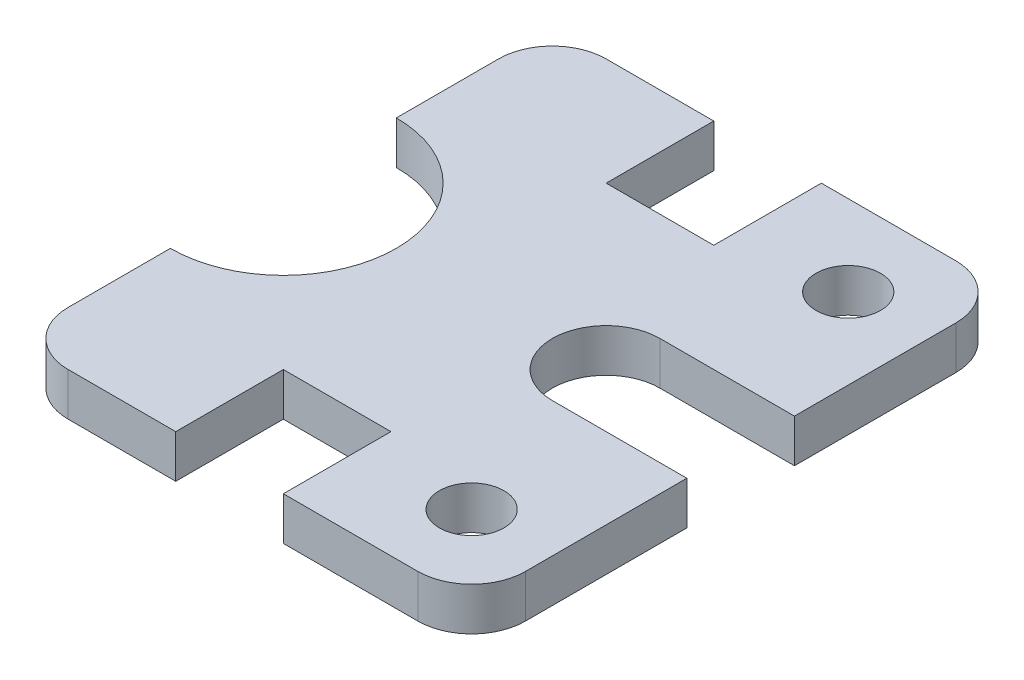
ISO-10303-21;
HEADER;
FILE_DESCRIPTION(('STEP AP214'),'2;1');
FILE_NAME('part.step','',(''),(''),'','','');
FILE_SCHEMA(('AUTOMOTIVE_DESIGN { 1 0 10303 214 1 1 1 1 }'));
ENDSEC;
DATA;
#1=APPLICATION_CONTEXT('core data for automotive mechanical design processes');
#2=APPLICATION_PROTOCOL_DEFINITION('international standard','automotive_design',2000,#1);
#3=PRODUCT_CONTEXT('',#1,'mechanical');
#4=PRODUCT('Part','Part','',(#3));
#5=PRODUCT_RELATED_PRODUCT_CATEGORY('part','',(#4));
#6=PRODUCT_DEFINITION_FORMATION('','',#4);
#7=PRODUCT_DEFINITION_CONTEXT('part definition',#1,'design');
#8=PRODUCT_DEFINITION('design','',#6,#7);
#9=PRODUCT_DEFINITION_SHAPE('','',#8);
#10=(LENGTH_UNIT() NAMED_UNIT(*) SI_UNIT(.MILLI.,.METRE.));
#11=(NAMED_UNIT(*) PLANE_ANGLE_UNIT() SI_UNIT($,.RADIAN.));
#12=(NAMED_UNIT(*) SI_UNIT($,.STERADIAN.) SOLID_ANGLE_UNIT());
#13=UNCERTAINTY_MEASURE_WITH_UNIT(LENGTH_MEASURE(1.E-05),#10,'distance_accuracy_value','');
#14=(GEOMETRIC_REPRESENTATION_CONTEXT(3) GLOBAL_UNCERTAINTY_ASSIGNED_CONTEXT((#13)) GLOBAL_UNIT_ASSIGNED_CONTEXT((#10,
#11,#12)) REPRESENTATION_CONTEXT('',''));
#15=CARTESIAN_POINT('',(0.,0.,0.));
#16=DIRECTION('',(0.,0.,1.));
#17=DIRECTION('',(1.,0.,0.));
#18=AXIS2_PLACEMENT_3D('',#15,#16,#17);
#19=CARTESIAN_POINT('',(-85.1016905402281,8.,10.1156747647356));
#20=DIRECTION('',(0.,1.,0.));
#21=DIRECTION('',(0.,0.,1.));
#22=AXIS2_PLACEMENT_3D('',#19,#20,#21);
#23=PLANE('',#22);
#24=CARTESIAN_POINT('',(-15.1016905402279,8.,-24.8843252352656));
#25=DIRECTION('',(0.,1.,0.));
#26=DIRECTION('',(0.,0.,1.));
#27=AXIS2_PLACEMENT_3D('',#24,#25,#26);
#28=CIRCLE('',#27,6.);
#29=CARTESIAN_POINT('',(-15.1016905402279,8.,-18.8843252352656));
#30=VERTEX_POINT('',#29);
#31=EDGE_CURVE('E222',#30,#30,#28,.T.);
#32=ORIENTED_EDGE('',*,*,#31,.F.);
#33=EDGE_LOOP('',(#32));
#34=FACE_BOUND('',#33,.T.);
#35=CARTESIAN_POINT('',(-85.1016905402281,8.,10.1156747647356));
#36=DIRECTION('',(0.,-1.,0.));
#37=DIRECTION('',(0.,0.,1.));
#38=AXIS2_PLACEMENT_3D('',#35,#36,#37);
#39=CIRCLE('',#38,21.);
#40=CARTESIAN_POINT('',(-85.1016905402281,8.,-10.8843252352644));
#41=VERTEX_POINT('',#40);
#42=CARTESIAN_POINT('',(-85.1016905402281,8.,31.1156747647356));
#43=VERTEX_POINT('',#42);
#44=EDGE_CURVE('E261',#41,#43,#39,.T.);
#45=ORIENTED_EDGE('',*,*,#44,.T.);
#46=DIRECTION('',(0.,0.,1.));
#47=VECTOR('',#46,1.);
#48=CARTESIAN_POINT('',(-85.1016905402281,8.,31.1156747647356));
#49=LINE('',#48,#47);
#50=CARTESIAN_POINT('',(-85.1016905402281,8.,50.1156747647355));
#51=VERTEX_POINT('',#50);
#52=EDGE_CURVE('E139',#43,#51,#49,.T.);
#53=ORIENTED_EDGE('',*,*,#52,.T.);
#54=CARTESIAN_POINT('',(-75.1016905402281,8.,50.1156747647356));
#55=DIRECTION('',(0.,1.,0.));
#56=DIRECTION('',(0.,0.,1.));
#57=AXIS2_PLACEMENT_3D('',#54,#55,#56);
#58=CIRCLE('',#57,10.);
#59=CARTESIAN_POINT('',(-75.101690540228,8.,60.1156747647356));
#60=VERTEX_POINT('',#59);
#61=EDGE_CURVE('E318',#51,#60,#58,.T.);
#62=ORIENTED_EDGE('',*,*,#61,.T.);
#63=DIRECTION('',(1.,0.,0.));
#64=VECTOR('',#63,1.);
#65=CARTESIAN_POINT('',(-75.101690540228,8.,60.1156747647356));
#66=LINE('',#65,#64);
#67=CARTESIAN_POINT('',(-55.1016905402281,8.,60.1156747647356));
#68=VERTEX_POINT('',#67);
#69=EDGE_CURVE('E337',#60,#68,#66,.T.);
#70=ORIENTED_EDGE('',*,*,#69,.T.);
#71=DIRECTION('',(0.,0.,-1.));
#72=VECTOR('',#71,1.);
#73=CARTESIAN_POINT('',(-55.1016905402281,8.,60.1156747647356));
#74=LINE('',#73,#72);
#75=CARTESIAN_POINT('',(-55.1016905402281,8.,40.1156747647356));
#76=VERTEX_POINT('',#75);
#77=EDGE_CURVE('E334',#68,#76,#74,.T.);
#78=ORIENTED_EDGE('',*,*,#77,.T.);
#79=DIRECTION('',(1.,0.,0.));
#80=VECTOR('',#79,1.);
#81=CARTESIAN_POINT('',(-55.1016905402281,8.,40.1156747647356));
#82=LINE('',#81,#80);
#83=CARTESIAN_POINT('',(-35.1016905402281,8.,40.1156747647356));
#84=VERTEX_POINT('',#83);
#85=EDGE_CURVE('E336',#76,#84,#82,.T.);
#86=ORIENTED_EDGE('',*,*,#85,.T.);
#87=DIRECTION('',(0.,0.,1.));
#88=VECTOR('',#87,1.);
#89=CARTESIAN_POINT('',(-35.1016905402279,8.,60.1156747647344));
#90=LINE('',#89,#88);
#91=CARTESIAN_POINT('',(-35.1016905402279,8.,60.1156747647344));
#92=VERTEX_POINT('',#91);
#93=EDGE_CURVE('E339',#84,#92,#90,.T.);
#94=ORIENTED_EDGE('',*,*,#93,.T.);
#95=DIRECTION('',(1.,0.,0.));
#96=VECTOR('',#95,1.);
#97=CARTESIAN_POINT('',(-35.1016905402279,8.,60.1156747647344));
#98=LINE('',#97,#96);
#99=CARTESIAN_POINT('',(-10.1016905402285,8.,60.1156747647344));
#100=VERTEX_POINT('',#99);
#101=EDGE_CURVE('E345',#92,#100,#98,.T.);
#102=ORIENTED_EDGE('',*,*,#101,.T.);
#103=CARTESIAN_POINT('',(-10.1016905402279,8.,50.1156747647344));
#104=DIRECTION('',(0.,1.,0.));
#105=DIRECTION('',(0.,0.,-1.));
#106=AXIS2_PLACEMENT_3D('',#103,#104,#105);
#107=CIRCLE('',#106,10.);
#108=CARTESIAN_POINT('',(-0.101690540227909,8.,50.1156747647344));
#109=VERTEX_POINT('',#108);
#110=EDGE_CURVE('E347',#100,#109,#107,.T.);
#111=ORIENTED_EDGE('',*,*,#110,.T.);
#112=DIRECTION('',(0.,0.,-1.));
#113=VECTOR('',#112,1.);
#114=CARTESIAN_POINT('',(-0.101690540227909,8.,50.1156747647344));
#115=LINE('',#114,#113);
#116=CARTESIAN_POINT('',(-0.101690540228438,8.,20.1156747647344));
#117=VERTEX_POINT('',#116);
#118=EDGE_CURVE('E349',#109,#117,#115,.T.);
#119=ORIENTED_EDGE('',*,*,#118,.T.);
#120=DIRECTION('',(-1.,0.,0.));
#121=VECTOR('',#120,1.);
#122=CARTESIAN_POINT('',(-25.1016905402279,8.,20.1156747647345));
#123=LINE('',#122,#121);
#124=CARTESIAN_POINT('',(-25.1016905402279,8.,20.1156747647357));
#125=VERTEX_POINT('',#124);
#126=EDGE_CURVE('E351',#117,#125,#123,.T.);
#127=ORIENTED_EDGE('',*,*,#126,.T.);
#128=CARTESIAN_POINT('',(-25.1016905402279,8.,10.1156747647356));
#129=DIRECTION('',(0.,-1.,0.));
#130=DIRECTION('',(0.,0.,-1.));
#131=AXIS2_PLACEMENT_3D('',#128,#129,#130);
#132=CIRCLE('',#131,10.);
#133=CARTESIAN_POINT('',(-25.1016905402279,8.,0.115674764734369));
#134=VERTEX_POINT('',#133);
#135=EDGE_CURVE('E353',#125,#134,#132,.T.);
#136=ORIENTED_EDGE('',*,*,#135,.T.);
#137=DIRECTION('',(1.,0.,0.));
#138=VECTOR('',#137,1.);
#139=CARTESIAN_POINT('',(-25.1016905402279,8.,0.115674764734369));
#140=LINE('',#139,#138);
#141=CARTESIAN_POINT('',(-0.101690540227909,8.,0.115674764734369));
#142=VERTEX_POINT('',#141);
#143=EDGE_CURVE('E355',#134,#142,#140,.T.);
#144=ORIENTED_EDGE('',*,*,#143,.T.);
#145=DIRECTION('',(0.,0.,-1.));
#146=VECTOR('',#145,1.);
#147=CARTESIAN_POINT('',(-0.101690540227911,8.,-29.8843252352656));
#148=LINE('',#147,#146);
#149=CARTESIAN_POINT('',(-0.101690540227909,8.,-29.8843252352656));
#150=VERTEX_POINT('',#149);
#151=EDGE_CURVE('E357',#142,#150,#148,.T.);
#152=ORIENTED_EDGE('',*,*,#151,.T.);
#153=CARTESIAN_POINT('',(-10.1016905402279,8.,-29.8843252352656));
#154=DIRECTION('',(0.,1.,0.));
#155=DIRECTION('',(0.,0.,-1.));
#156=AXIS2_PLACEMENT_3D('',#153,#154,#155);
#157=CIRCLE('',#156,10.);
#158=CARTESIAN_POINT('',(-10.1016905402279,8.,-39.8843252352656));
#159=VERTEX_POINT('',#158);
#160=EDGE_CURVE('E359',#150,#159,#157,.T.);
#161=ORIENTED_EDGE('',*,*,#160,.T.);
#162=DIRECTION('',(-1.,0.,0.));
#163=VECTOR('',#162,1.);
#164=CARTESIAN_POINT('',(-35.1016905402279,8.,-39.8843252352656));
#165=LINE('',#164,#163);
#166=CARTESIAN_POINT('',(-35.1016905402279,8.,-39.8843252352656));
#167=VERTEX_POINT('',#166);
#168=EDGE_CURVE('E361',#159,#167,#165,.T.);
#169=ORIENTED_EDGE('',*,*,#168,.T.);
#170=DIRECTION('',(0.,0.,1.));
#171=VECTOR('',#170,1.);
#172=CARTESIAN_POINT('',(-35.1016905402279,8.,-39.8843252352656));
#173=LINE('',#172,#171);
#174=CARTESIAN_POINT('',(-35.1016905402279,8.,-19.8843252352644));
#175=VERTEX_POINT('',#174);
#176=EDGE_CURVE('E363',#167,#175,#173,.T.);
#177=ORIENTED_EDGE('',*,*,#176,.T.);
#178=DIRECTION('',(-1.,0.,0.));
#179=VECTOR('',#178,1.);
#180=CARTESIAN_POINT('',(-55.1016905402279,8.,-19.8843252352644));
#181=LINE('',#180,#179);
#182=CARTESIAN_POINT('',(-55.1016905402279,8.,-19.8843252352644));
#183=VERTEX_POINT('',#182);
#184=EDGE_CURVE('E365',#175,#183,#181,.T.);
#185=ORIENTED_EDGE('',*,*,#184,.T.);
#186=DIRECTION('',(0.,0.,-1.));
#187=VECTOR('',#186,1.);
#188=CARTESIAN_POINT('',(-55.1016905402279,8.,-39.8843252352644));
#189=LINE('',#188,#187);
#190=CARTESIAN_POINT('',(-55.1016905402279,8.,-39.8843252352644));
#191=VERTEX_POINT('',#190);
#192=EDGE_CURVE('E200',#183,#191,#189,.T.);
#193=ORIENTED_EDGE('',*,*,#192,.T.);
#194=DIRECTION('',(-1.,0.,0.));
#195=VECTOR('',#194,1.);
#196=CARTESIAN_POINT('',(-75.1016905402285,8.,-39.8843252352644));
#197=LINE('',#196,#195);
#198=CARTESIAN_POINT('',(-75.1016905402285,8.,-39.8843252352644));
#199=VERTEX_POINT('',#198);
#200=EDGE_CURVE('E194',#191,#199,#197,.T.);
#201=ORIENTED_EDGE('',*,*,#200,.T.);
#202=CARTESIAN_POINT('',(-75.1016905402285,8.,-29.8843252352644));
#203=DIRECTION('',(0.,1.,0.));
#204=DIRECTION('',(0.,0.,-1.));
#205=AXIS2_PLACEMENT_3D('',#202,#203,#204);
#206=CIRCLE('',#205,10.);
#207=CARTESIAN_POINT('',(-85.1016905402284,8.,-29.8843252352644));
#208=VERTEX_POINT('',#207);
#209=EDGE_CURVE('E198',#199,#208,#206,.T.);
#210=ORIENTED_EDGE('',*,*,#209,.T.);
#211=DIRECTION('',(0.,0.,1.));
#212=VECTOR('',#211,1.);
#213=CARTESIAN_POINT('',(-85.1016905402281,8.,-10.8843252352644));
#214=LINE('',#213,#212);
#215=EDGE_CURVE('E54',#208,#41,#214,.T.);
#216=ORIENTED_EDGE('',*,*,#215,.T.);
#217=EDGE_LOOP('',(#45,#53,#62,#70,#78,#86,#94,#102,#111,#119,#127,#136,#144,#152,#161,#169,
#177,#185,#193,#201,#210,#216));
#218=FACE_BOUND('',#217,.T.);
#219=CARTESIAN_POINT('',(-15.1016905402279,8.,45.1156747647344));
#220=DIRECTION('',(0.,1.,0.));
#221=DIRECTION('',(0.,0.,-1.));
#222=AXIS2_PLACEMENT_3D('',#219,#220,#221);
#223=CIRCLE('',#222,6.);
#224=CARTESIAN_POINT('',(-15.1016905402279,8.,39.1156747647344));
#225=VERTEX_POINT('',#224);
#226=EDGE_CURVE('E407',#225,#225,#223,.T.);
#227=ORIENTED_EDGE('',*,*,#226,.F.);
#228=EDGE_LOOP('',(#227));
#229=FACE_BOUND('',#228,.T.);
#230=ADVANCED_FACE('F37',(#34,#218,#229),#23,.T.);
#231=CARTESIAN_POINT('',(-85.1016905402281,0.,10.1156747647356));
#232=DIRECTION('',(0.,1.,0.));
#233=DIRECTION('',(0.,0.,1.));
#234=AXIS2_PLACEMENT_3D('',#231,#232,#233);
#235=PLANE('',#234);
#236=CARTESIAN_POINT('',(-85.1016905402281,0.,10.1156747647356));
#237=DIRECTION('',(0.,-1.,0.));
#238=DIRECTION('',(0.,0.,1.));
#239=AXIS2_PLACEMENT_3D('',#236,#237,#238);
#240=CIRCLE('',#239,21.);
#241=CARTESIAN_POINT('',(-85.1016905402281,0.,-10.8843252352644));
#242=VERTEX_POINT('',#241);
#243=CARTESIAN_POINT('',(-85.1016905402281,0.,31.1156747647356));
#244=VERTEX_POINT('',#243);
#245=EDGE_CURVE('E218',#242,#244,#240,.T.);
#246=ORIENTED_EDGE('',*,*,#245,.F.);
#247=DIRECTION('',(0.,0.,1.));
#248=VECTOR('',#247,1.);
#249=CARTESIAN_POINT('',(-85.1016905402281,0.,-10.8843252352644));
#250=LINE('',#249,#248);
#251=CARTESIAN_POINT('',(-85.1016905402284,0.,-29.8843252352644));
#252=VERTEX_POINT('',#251);
#253=EDGE_CURVE('E131',#252,#242,#250,.T.);
#254=ORIENTED_EDGE('',*,*,#253,.F.);
#255=CARTESIAN_POINT('',(-75.1016905402285,0.,-29.8843252352644));
#256=DIRECTION('',(0.,1.,0.));
#257=DIRECTION('',(0.,0.,-1.));
#258=AXIS2_PLACEMENT_3D('',#255,#256,#257);
#259=CIRCLE('',#258,10.);
#260=CARTESIAN_POINT('',(-75.1016905402285,0.,-39.8843252352644));
#261=VERTEX_POINT('',#260);
#262=EDGE_CURVE('E125',#261,#252,#259,.T.);
#263=ORIENTED_EDGE('',*,*,#262,.F.);
#264=DIRECTION('',(-1.,0.,0.));
#265=VECTOR('',#264,1.);
#266=CARTESIAN_POINT('',(-75.1016905402285,0.,-39.8843252352644));
#267=LINE('',#266,#265);
#268=CARTESIAN_POINT('',(-55.1016905402279,0.,-39.8843252352644));
#269=VERTEX_POINT('',#268);
#270=EDGE_CURVE('E208',#269,#261,#267,.T.);
#271=ORIENTED_EDGE('',*,*,#270,.F.);
#272=DIRECTION('',(0.,0.,-1.));
#273=VECTOR('',#272,1.);
#274=CARTESIAN_POINT('',(-55.1016905402279,0.,-39.8843252352644));
#275=LINE('',#274,#273);
#276=CARTESIAN_POINT('',(-55.1016905402279,0.,-19.8843252352644));
#277=VERTEX_POINT('',#276);
#278=EDGE_CURVE('E256',#277,#269,#275,.T.);
#279=ORIENTED_EDGE('',*,*,#278,.F.);
#280=DIRECTION('',(-1.,0.,0.));
#281=VECTOR('',#280,1.);
#282=CARTESIAN_POINT('',(-55.1016905402279,0.,-19.8843252352644));
#283=LINE('',#282,#281);
#284=CARTESIAN_POINT('',(-35.1016905402279,0.,-19.8843252352644));
#285=VERTEX_POINT('',#284);
#286=EDGE_CURVE('E254',#285,#277,#283,.T.);
#287=ORIENTED_EDGE('',*,*,#286,.F.);
#288=DIRECTION('',(0.,0.,1.));
#289=VECTOR('',#288,1.);
#290=CARTESIAN_POINT('',(-35.1016905402279,0.,-39.8843252352656));
#291=LINE('',#290,#289);
#292=CARTESIAN_POINT('',(-35.1016905402279,0.,-39.8843252352656));
#293=VERTEX_POINT('',#292);
#294=EDGE_CURVE('E252',#293,#285,#291,.T.);
#295=ORIENTED_EDGE('',*,*,#294,.F.);
#296=DIRECTION('',(-1.,0.,0.));
#297=VECTOR('',#296,1.);
#298=CARTESIAN_POINT('',(-35.1016905402279,0.,-39.8843252352656));
#299=LINE('',#298,#297);
#300=CARTESIAN_POINT('',(-10.1016905402279,0.,-39.8843252352656));
#301=VERTEX_POINT('',#300);
#302=EDGE_CURVE('E250',#301,#293,#299,.T.);
#303=ORIENTED_EDGE('',*,*,#302,.F.);
#304=CARTESIAN_POINT('',(-10.1016905402279,0.,-29.8843252352656));
#305=DIRECTION('',(0.,1.,0.));
#306=DIRECTION('',(0.,0.,-1.));
#307=AXIS2_PLACEMENT_3D('',#304,#305,#306);
#308=CIRCLE('',#307,10.);
#309=CARTESIAN_POINT('',(-0.101690540227909,0.,-29.8843252352656));
#310=VERTEX_POINT('',#309);
#311=EDGE_CURVE('E248',#310,#301,#308,.T.);
#312=ORIENTED_EDGE('',*,*,#311,.F.);
#313=DIRECTION('',(0.,0.,-1.));
#314=VECTOR('',#313,1.);
#315=CARTESIAN_POINT('',(-0.101690540227911,0.,-29.8843252352656));
#316=LINE('',#315,#314);
#317=CARTESIAN_POINT('',(-0.101690540227909,0.,0.115674764734369));
#318=VERTEX_POINT('',#317);
#319=EDGE_CURVE('E246',#318,#310,#316,.T.);
#320=ORIENTED_EDGE('',*,*,#319,.F.);
#321=DIRECTION('',(1.,0.,0.));
#322=VECTOR('',#321,1.);
#323=CARTESIAN_POINT('',(-25.1016905402279,0.,0.115674764734369));
#324=LINE('',#323,#322);
#325=CARTESIAN_POINT('',(-25.1016905402279,0.,0.115674764734369));
#326=VERTEX_POINT('',#325);
#327=EDGE_CURVE('E244',#326,#318,#324,.T.);
#328=ORIENTED_EDGE('',*,*,#327,.F.);
#329=CARTESIAN_POINT('',(-25.1016905402279,0.,10.1156747647356));
#330=DIRECTION('',(0.,-1.,0.));
#331=DIRECTION('',(0.,0.,-1.));
#332=AXIS2_PLACEMENT_3D('',#329,#330,#331);
#333=CIRCLE('',#332,10.);
#334=CARTESIAN_POINT('',(-25.1016905402279,0.,20.1156747647357));
#335=VERTEX_POINT('',#334);
#336=EDGE_CURVE('E242',#335,#326,#333,.T.);
#337=ORIENTED_EDGE('',*,*,#336,.F.);
#338=DIRECTION('',(-1.,0.,0.));
#339=VECTOR('',#338,1.);
#340=CARTESIAN_POINT('',(-25.1016905402279,0.,20.1156747647345));
#341=LINE('',#340,#339);
#342=CARTESIAN_POINT('',(-0.101690540228438,0.,20.1156747647344));
#343=VERTEX_POINT('',#342);
#344=EDGE_CURVE('E240',#343,#335,#341,.T.);
#345=ORIENTED_EDGE('',*,*,#344,.F.);
#346=DIRECTION('',(0.,0.,-1.));
#347=VECTOR('',#346,1.);
#348=CARTESIAN_POINT('',(-0.101690540227909,0.,50.1156747647344));
#349=LINE('',#348,#347);
#350=CARTESIAN_POINT('',(-0.101690540227909,0.,50.1156747647344));
#351=VERTEX_POINT('',#350);
#352=EDGE_CURVE('E238',#351,#343,#349,.T.);
#353=ORIENTED_EDGE('',*,*,#352,.F.);
#354=CARTESIAN_POINT('',(-10.1016905402279,0.,50.1156747647344));
#355=DIRECTION('',(0.,1.,0.));
#356=DIRECTION('',(0.,0.,-1.));
#357=AXIS2_PLACEMENT_3D('',#354,#355,#356);
#358=CIRCLE('',#357,10.);
#359=CARTESIAN_POINT('',(-10.1016905402285,0.,60.1156747647344));
#360=VERTEX_POINT('',#359);
#361=EDGE_CURVE('E236',#360,#351,#358,.T.);
#362=ORIENTED_EDGE('',*,*,#361,.F.);
#363=DIRECTION('',(1.,0.,0.));
#364=VECTOR('',#363,1.);
#365=CARTESIAN_POINT('',(-35.1016905402279,0.,60.1156747647344));
#366=LINE('',#365,#364);
#367=CARTESIAN_POINT('',(-35.1016905402279,0.,60.1156747647344));
#368=VERTEX_POINT('',#367);
#369=EDGE_CURVE('E234',#368,#360,#366,.T.);
#370=ORIENTED_EDGE('',*,*,#369,.F.);
#371=DIRECTION('',(0.,0.,1.));
#372=VECTOR('',#371,1.);
#373=CARTESIAN_POINT('',(-35.1016905402279,0.,60.1156747647344));
#374=LINE('',#373,#372);
#375=CARTESIAN_POINT('',(-35.1016905402281,0.,40.1156747647356));
#376=VERTEX_POINT('',#375);
#377=EDGE_CURVE('E232',#376,#368,#374,.T.);
#378=ORIENTED_EDGE('',*,*,#377,.F.);
#379=DIRECTION('',(1.,0.,0.));
#380=VECTOR('',#379,1.);
#381=CARTESIAN_POINT('',(-55.1016905402281,0.,40.1156747647356));
#382=LINE('',#381,#380);
#383=CARTESIAN_POINT('',(-55.1016905402281,0.,40.1156747647356));
#384=VERTEX_POINT('',#383);
#385=EDGE_CURVE('E230',#384,#376,#382,.T.);
#386=ORIENTED_EDGE('',*,*,#385,.F.);
#387=DIRECTION('',(0.,0.,-1.));
#388=VECTOR('',#387,1.);
#389=CARTESIAN_POINT('',(-55.1016905402281,0.,60.1156747647356));
#390=LINE('',#389,#388);
#391=CARTESIAN_POINT('',(-55.1016905402281,0.,60.1156747647356));
#392=VERTEX_POINT('',#391);
#393=EDGE_CURVE('E228',#392,#384,#390,.T.);
#394=ORIENTED_EDGE('',*,*,#393,.F.);
#395=DIRECTION('',(1.,0.,0.));
#396=VECTOR('',#395,1.);
#397=CARTESIAN_POINT('',(-75.101690540228,0.,60.1156747647356));
#398=LINE('',#397,#396);
#399=CARTESIAN_POINT('',(-75.101690540228,0.,60.1156747647356));
#400=VERTEX_POINT('',#399);
#401=EDGE_CURVE('E226',#400,#392,#398,.T.);
#402=ORIENTED_EDGE('',*,*,#401,.F.);
#403=CARTESIAN_POINT('',(-75.1016905402281,0.,50.1156747647356));
#404=DIRECTION('',(0.,1.,0.));
#405=DIRECTION('',(0.,0.,1.));
#406=AXIS2_PLACEMENT_3D('',#403,#404,#405);
#407=CIRCLE('',#406,10.);
#408=CARTESIAN_POINT('',(-85.1016905402281,0.,50.1156747647355));
#409=VERTEX_POINT('',#408);
#410=EDGE_CURVE('E224',#409,#400,#407,.T.);
#411=ORIENTED_EDGE('',*,*,#410,.F.);
#412=DIRECTION('',(0.,0.,1.));
#413=VECTOR('',#412,1.);
#414=CARTESIAN_POINT('',(-85.1016905402281,0.,31.1156747647356));
#415=LINE('',#414,#413);
#416=EDGE_CURVE('E221',#244,#409,#415,.T.);
#417=ORIENTED_EDGE('',*,*,#416,.F.);
#418=EDGE_LOOP('',(#246,#254,#263,#271,#279,#287,#295,#303,#312,#320,#328,#337,#345,#353,#362,
#370,#378,#386,#394,#402,#411,#417));
#419=FACE_BOUND('',#418,.T.);
#420=CARTESIAN_POINT('',(-15.1016905402279,0.,-24.8843252352656));
#421=DIRECTION('',(0.,1.,0.));
#422=DIRECTION('',(0.,0.,1.));
#423=AXIS2_PLACEMENT_3D('',#420,#421,#422);
#424=CIRCLE('',#423,6.);
#425=CARTESIAN_POINT('',(-15.1016905402279,0.,-18.8843252352656));
#426=VERTEX_POINT('',#425);
#427=EDGE_CURVE('E413',#426,#426,#424,.T.);
#428=ORIENTED_EDGE('',*,*,#427,.T.);
#429=EDGE_LOOP('',(#428));
#430=FACE_BOUND('',#429,.T.);
#431=CARTESIAN_POINT('',(-15.1016905402279,0.,45.1156747647344));
#432=DIRECTION('',(0.,1.,0.));
#433=DIRECTION('',(0.,0.,-1.));
#434=AXIS2_PLACEMENT_3D('',#431,#432,#433);
#435=CIRCLE('',#434,6.);
#436=CARTESIAN_POINT('',(-15.1016905402279,0.,39.1156747647344));
#437=VERTEX_POINT('',#436);
#438=EDGE_CURVE('E410',#437,#437,#435,.T.);
#439=ORIENTED_EDGE('',*,*,#438,.T.);
#440=EDGE_LOOP('',(#439));
#441=FACE_BOUND('',#440,.T.);
#442=ADVANCED_FACE('F322',(#419,#430,#441),#235,.F.);
#443=CARTESIAN_POINT('',(-85.1016905402281,8.,10.1156747647356));
#444=DIRECTION('',(0.,-1.,0.));
#445=DIRECTION('',(0.,0.,-1.));
#446=AXIS2_PLACEMENT_3D('',#443,#444,#445);
#447=CYLINDRICAL_SURFACE('',#446,21.);
#448=ORIENTED_EDGE('',*,*,#245,.T.);
#449=DIRECTION('',(0.,-1.,0.));
#450=VECTOR('',#449,1.);
#451=CARTESIAN_POINT('',(-85.1016905402281,8.,31.1156747647356));
#452=LINE('',#451,#450);
#453=EDGE_CURVE('E11',#43,#244,#452,.T.);
#454=ORIENTED_EDGE('',*,*,#453,.F.);
#455=ORIENTED_EDGE('',*,*,#44,.F.);
#456=DIRECTION('',(0.,-1.,0.));
#457=VECTOR('',#456,1.);
#458=CARTESIAN_POINT('',(-85.1016905402281,8.,-10.8843252352644));
#459=LINE('',#458,#457);
#460=EDGE_CURVE('E214',#41,#242,#459,.T.);
#461=ORIENTED_EDGE('',*,*,#460,.T.);
#462=EDGE_LOOP('',(#448,#454,#455,#461));
#463=FACE_BOUND('',#462,.T.);
#464=ADVANCED_FACE('F39',(#463),#447,.F.);
#465=CARTESIAN_POINT('',(-85.1016905402281,8.,31.1156747647356));
#466=DIRECTION('',(1.,0.,0.));
#467=DIRECTION('',(0.,0.,-1.));
#468=AXIS2_PLACEMENT_3D('',#465,#466,#467);
#469=PLANE('',#468);
#470=ORIENTED_EDGE('',*,*,#416,.T.);
#471=DIRECTION('',(0.,-1.,0.));
#472=VECTOR('',#471,1.);
#473=CARTESIAN_POINT('',(-85.1016905402281,8.,50.1156747647355));
#474=LINE('',#473,#472);
#475=EDGE_CURVE('E46',#51,#409,#474,.T.);
#476=ORIENTED_EDGE('',*,*,#475,.F.);
#477=ORIENTED_EDGE('',*,*,#52,.F.);
#478=ORIENTED_EDGE('',*,*,#453,.T.);
#479=EDGE_LOOP('',(#470,#476,#477,#478));
#480=FACE_BOUND('',#479,.T.);
#481=ADVANCED_FACE('F606',(#480),#469,.F.);
#482=CARTESIAN_POINT('',(-75.1016905402281,8.,50.1156747647356));
#483=DIRECTION('',(0.,-1.,0.));
#484=DIRECTION('',(0.,0.,-1.));
#485=AXIS2_PLACEMENT_3D('',#482,#483,#484);
#486=CYLINDRICAL_SURFACE('',#485,10.);
#487=ORIENTED_EDGE('',*,*,#410,.T.);
#488=DIRECTION('',(0.,-1.,0.));
#489=VECTOR('',#488,1.);
#490=CARTESIAN_POINT('',(-75.101690540228,8.,60.1156747647356));
#491=LINE('',#490,#489);
#492=EDGE_CURVE('E310',#60,#400,#491,.T.);
#493=ORIENTED_EDGE('',*,*,#492,.F.);
#494=ORIENTED_EDGE('',*,*,#61,.F.);
#495=ORIENTED_EDGE('',*,*,#475,.T.);
#496=EDGE_LOOP('',(#487,#493,#494,#495));
#497=FACE_BOUND('',#496,.T.);
#498=ADVANCED_FACE('F316',(#497),#486,.T.);
#499=CARTESIAN_POINT('',(-75.101690540228,8.,60.1156747647356));
#500=DIRECTION('',(0.,0.,-1.));
#501=DIRECTION('',(-1.,0.,0.));
#502=AXIS2_PLACEMENT_3D('',#499,#500,#501);
#503=PLANE('',#502);
#504=ORIENTED_EDGE('',*,*,#401,.T.);
#505=DIRECTION('',(0.,-1.,0.));
#506=VECTOR('',#505,1.);
#507=CARTESIAN_POINT('',(-55.1016905402281,8.,60.1156747647356));
#508=LINE('',#507,#506);
#509=EDGE_CURVE('E307',#68,#392,#508,.T.);
#510=ORIENTED_EDGE('',*,*,#509,.F.);
#511=ORIENTED_EDGE('',*,*,#69,.F.);
#512=ORIENTED_EDGE('',*,*,#492,.T.);
#513=EDGE_LOOP('',(#504,#510,#511,#512));
#514=FACE_BOUND('',#513,.T.);
#515=ADVANCED_FACE('F328',(#514),#503,.F.);
#516=CARTESIAN_POINT('',(-55.1016905402281,8.,60.1156747647356));
#517=DIRECTION('',(-1.,0.,0.));
#518=DIRECTION('',(0.,0.,1.));
#519=AXIS2_PLACEMENT_3D('',#516,#517,#518);
#520=PLANE('',#519);
#521=ORIENTED_EDGE('',*,*,#393,.T.);
#522=DIRECTION('',(0.,-1.,0.));
#523=VECTOR('',#522,1.);
#524=CARTESIAN_POINT('',(-55.1016905402281,8.,40.1156747647356));
#525=LINE('',#524,#523);
#526=EDGE_CURVE('E304',#76,#384,#525,.T.);
#527=ORIENTED_EDGE('',*,*,#526,.F.);
#528=ORIENTED_EDGE('',*,*,#77,.F.);
#529=ORIENTED_EDGE('',*,*,#509,.T.);
#530=EDGE_LOOP('',(#521,#527,#528,#529));
#531=FACE_BOUND('',#530,.T.);
#532=ADVANCED_FACE('F332',(#531),#520,.F.);
#533=CARTESIAN_POINT('',(-55.1016905402281,8.,40.1156747647356));
#534=DIRECTION('',(0.,0.,-1.));
#535=DIRECTION('',(-1.,0.,0.));
#536=AXIS2_PLACEMENT_3D('',#533,#534,#535);
#537=PLANE('',#536);
#538=ORIENTED_EDGE('',*,*,#385,.T.);
#539=DIRECTION('',(0.,-1.,0.));
#540=VECTOR('',#539,1.);
#541=CARTESIAN_POINT('',(-35.1016905402281,8.,40.1156747647356));
#542=LINE('',#541,#540);
#543=EDGE_CURVE('E301',#84,#376,#542,.T.);
#544=ORIENTED_EDGE('',*,*,#543,.F.);
#545=ORIENTED_EDGE('',*,*,#85,.F.);
#546=ORIENTED_EDGE('',*,*,#526,.T.);
#547=EDGE_LOOP('',(#538,#544,#545,#546));
#548=FACE_BOUND('',#547,.T.);
#549=ADVANCED_FACE('F571',(#548),#537,.F.);
#550=CARTESIAN_POINT('',(-35.1016905402279,8.,60.1156747647344));
#551=DIRECTION('',(1.,0.,0.));
#552=DIRECTION('',(0.,0.,-1.));
#553=AXIS2_PLACEMENT_3D('',#550,#551,#552);
#554=PLANE('',#553);
#555=ORIENTED_EDGE('',*,*,#377,.T.);
#556=DIRECTION('',(0.,-1.,0.));
#557=VECTOR('',#556,1.);
#558=CARTESIAN_POINT('',(-35.1016905402279,8.,60.1156747647344));
#559=LINE('',#558,#557);
#560=EDGE_CURVE('E298',#92,#368,#559,.T.);
#561=ORIENTED_EDGE('',*,*,#560,.F.);
#562=ORIENTED_EDGE('',*,*,#93,.F.);
#563=ORIENTED_EDGE('',*,*,#543,.T.);
#564=EDGE_LOOP('',(#555,#561,#562,#563));
#565=FACE_BOUND('',#564,.T.);
#566=ADVANCED_FACE('F561',(#565),#554,.F.);
#567=CARTESIAN_POINT('',(-35.1016905402279,8.,60.1156747647344));
#568=DIRECTION('',(0.,0.,-1.));
#569=DIRECTION('',(-1.,0.,0.));
#570=AXIS2_PLACEMENT_3D('',#567,#568,#569);
#571=PLANE('',#570);
#572=ORIENTED_EDGE('',*,*,#369,.T.);
#573=DIRECTION('',(0.,-1.,0.));
#574=VECTOR('',#573,1.);
#575=CARTESIAN_POINT('',(-10.1016905402285,8.,60.1156747647344));
#576=LINE('',#575,#574);
#577=EDGE_CURVE('E295',#100,#360,#576,.T.);
#578=ORIENTED_EDGE('',*,*,#577,.F.);
#579=ORIENTED_EDGE('',*,*,#101,.F.);
#580=ORIENTED_EDGE('',*,*,#560,.T.);
#581=EDGE_LOOP('',(#572,#578,#579,#580));
#582=FACE_BOUND('',#581,.T.);
#583=ADVANCED_FACE('F551',(#582),#571,.F.);
#584=CARTESIAN_POINT('',(-10.1016905402279,8.,50.1156747647344));
#585=DIRECTION('',(0.,-1.,0.));
#586=DIRECTION('',(0.,0.,-1.));
#587=AXIS2_PLACEMENT_3D('',#584,#585,#586);
#588=CYLINDRICAL_SURFACE('',#587,10.);
#589=ORIENTED_EDGE('',*,*,#361,.T.);
#590=DIRECTION('',(0.,-1.,0.));
#591=VECTOR('',#590,1.);
#592=CARTESIAN_POINT('',(-0.101690540227909,8.,50.1156747647344));
#593=LINE('',#592,#591);
#594=EDGE_CURVE('E292',#109,#351,#593,.T.);
#595=ORIENTED_EDGE('',*,*,#594,.F.);
#596=ORIENTED_EDGE('',*,*,#110,.F.);
#597=ORIENTED_EDGE('',*,*,#577,.T.);
#598=EDGE_LOOP('',(#589,#595,#596,#597));
#599=FACE_BOUND('',#598,.T.);
#600=ADVANCED_FACE('F541',(#599),#588,.T.);
#601=CARTESIAN_POINT('',(-0.101690540227909,8.,50.1156747647344));
#602=DIRECTION('',(-1.,0.,0.));
#603=DIRECTION('',(0.,0.,1.));
#604=AXIS2_PLACEMENT_3D('',#601,#602,#603);
#605=PLANE('',#604);
#606=ORIENTED_EDGE('',*,*,#352,.T.);
#607=DIRECTION('',(0.,-1.,0.));
#608=VECTOR('',#607,1.);
#609=CARTESIAN_POINT('',(-0.101690540228438,8.,20.1156747647344));
#610=LINE('',#609,#608);
#611=EDGE_CURVE('E289',#117,#343,#610,.T.);
#612=ORIENTED_EDGE('',*,*,#611,.F.);
#613=ORIENTED_EDGE('',*,*,#118,.F.);
#614=ORIENTED_EDGE('',*,*,#594,.T.);
#615=EDGE_LOOP('',(#606,#612,#613,#614));
#616=FACE_BOUND('',#615,.T.);
#617=ADVANCED_FACE('F531',(#616),#605,.F.);
#618=CARTESIAN_POINT('',(-25.1016905402279,8.,20.1156747647345));
#619=DIRECTION('',(0.,0.,1.));
#620=DIRECTION('',(1.,0.,0.));
#621=AXIS2_PLACEMENT_3D('',#618,#619,#620);
#622=PLANE('',#621);
#623=ORIENTED_EDGE('',*,*,#344,.T.);
#624=DIRECTION('',(0.,-1.,0.));
#625=VECTOR('',#624,1.);
#626=CARTESIAN_POINT('',(-25.1016905402279,8.,20.1156747647357));
#627=LINE('',#626,#625);
#628=EDGE_CURVE('E286',#125,#335,#627,.T.);
#629=ORIENTED_EDGE('',*,*,#628,.F.);
#630=ORIENTED_EDGE('',*,*,#126,.F.);
#631=ORIENTED_EDGE('',*,*,#611,.T.);
#632=EDGE_LOOP('',(#623,#629,#630,#631));
#633=FACE_BOUND('',#632,.T.);
#634=ADVANCED_FACE('F521',(#633),#622,.F.);
#635=CARTESIAN_POINT('',(-25.1016905402279,8.,10.1156747647356));
#636=DIRECTION('',(0.,-1.,0.));
#637=DIRECTION('',(0.,0.,-1.));
#638=AXIS2_PLACEMENT_3D('',#635,#636,#637);
#639=CYLINDRICAL_SURFACE('',#638,10.);
#640=ORIENTED_EDGE('',*,*,#336,.T.);
#641=DIRECTION('',(0.,-1.,0.));
#642=VECTOR('',#641,1.);
#643=CARTESIAN_POINT('',(-25.1016905402279,8.,0.115674764734369));
#644=LINE('',#643,#642);
#645=EDGE_CURVE('E283',#134,#326,#644,.T.);
#646=ORIENTED_EDGE('',*,*,#645,.F.);
#647=ORIENTED_EDGE('',*,*,#135,.F.);
#648=ORIENTED_EDGE('',*,*,#628,.T.);
#649=EDGE_LOOP('',(#640,#646,#647,#648));
#650=FACE_BOUND('',#649,.T.);
#651=ADVANCED_FACE('F511',(#650),#639,.F.);
#652=CARTESIAN_POINT('',(-25.1016905402279,8.,0.115674764734369));
#653=DIRECTION('',(0.,0.,-1.));
#654=DIRECTION('',(-1.,0.,0.));
#655=AXIS2_PLACEMENT_3D('',#652,#653,#654);
#656=PLANE('',#655);
#657=ORIENTED_EDGE('',*,*,#327,.T.);
#658=DIRECTION('',(0.,-1.,0.));
#659=VECTOR('',#658,1.);
#660=CARTESIAN_POINT('',(-0.101690540227909,8.,0.115674764734369));
#661=LINE('',#660,#659);
#662=EDGE_CURVE('E280',#142,#318,#661,.T.);
#663=ORIENTED_EDGE('',*,*,#662,.F.);
#664=ORIENTED_EDGE('',*,*,#143,.F.);
#665=ORIENTED_EDGE('',*,*,#645,.T.);
#666=EDGE_LOOP('',(#657,#663,#664,#665));
#667=FACE_BOUND('',#666,.T.);
#668=ADVANCED_FACE('F501',(#667),#656,.F.);
#669=CARTESIAN_POINT('',(-0.101690540227911,8.,-29.8843252352656));
#670=DIRECTION('',(-1.,0.,0.));
#671=DIRECTION('',(0.,0.,1.));
#672=AXIS2_PLACEMENT_3D('',#669,#670,#671);
#673=PLANE('',#672);
#674=ORIENTED_EDGE('',*,*,#319,.T.);
#675=DIRECTION('',(0.,-1.,0.));
#676=VECTOR('',#675,1.);
#677=CARTESIAN_POINT('',(-0.101690540227909,8.,-29.8843252352656));
#678=LINE('',#677,#676);
#679=EDGE_CURVE('E277',#150,#310,#678,.T.);
#680=ORIENTED_EDGE('',*,*,#679,.F.);
#681=ORIENTED_EDGE('',*,*,#151,.F.);
#682=ORIENTED_EDGE('',*,*,#662,.T.);
#683=EDGE_LOOP('',(#674,#680,#681,#682));
#684=FACE_BOUND('',#683,.T.);
#685=ADVANCED_FACE('F491',(#684),#673,.F.);
#686=CARTESIAN_POINT('',(-10.1016905402279,8.,-29.8843252352656));
#687=DIRECTION('',(0.,-1.,0.));
#688=DIRECTION('',(0.,0.,-1.));
#689=AXIS2_PLACEMENT_3D('',#686,#687,#688);
#690=CYLINDRICAL_SURFACE('',#689,10.);
#691=ORIENTED_EDGE('',*,*,#311,.T.);
#692=DIRECTION('',(0.,-1.,0.));
#693=VECTOR('',#692,1.);
#694=CARTESIAN_POINT('',(-10.1016905402279,8.,-39.8843252352656));
#695=LINE('',#694,#693);
#696=EDGE_CURVE('E274',#159,#301,#695,.T.);
#697=ORIENTED_EDGE('',*,*,#696,.F.);
#698=ORIENTED_EDGE('',*,*,#160,.F.);
#699=ORIENTED_EDGE('',*,*,#679,.T.);
#700=EDGE_LOOP('',(#691,#697,#698,#699));
#701=FACE_BOUND('',#700,.T.);
#702=ADVANCED_FACE('F481',(#701),#690,.T.);
#703=CARTESIAN_POINT('',(-35.1016905402279,8.,-39.8843252352656));
#704=DIRECTION('',(0.,0.,1.));
#705=DIRECTION('',(1.,0.,0.));
#706=AXIS2_PLACEMENT_3D('',#703,#704,#705);
#707=PLANE('',#706);
#708=ORIENTED_EDGE('',*,*,#302,.T.);
#709=DIRECTION('',(0.,-1.,0.));
#710=VECTOR('',#709,1.);
#711=CARTESIAN_POINT('',(-35.1016905402279,8.,-39.8843252352656));
#712=LINE('',#711,#710);
#713=EDGE_CURVE('E271',#167,#293,#712,.T.);
#714=ORIENTED_EDGE('',*,*,#713,.F.);
#715=ORIENTED_EDGE('',*,*,#168,.F.);
#716=ORIENTED_EDGE('',*,*,#696,.T.);
#717=EDGE_LOOP('',(#708,#714,#715,#716));
#718=FACE_BOUND('',#717,.T.);
#719=ADVANCED_FACE('F471',(#718),#707,.F.);
#720=CARTESIAN_POINT('',(-35.1016905402279,8.,-39.8843252352656));
#721=DIRECTION('',(1.,0.,0.));
#722=DIRECTION('',(0.,0.,-1.));
#723=AXIS2_PLACEMENT_3D('',#720,#721,#722);
#724=PLANE('',#723);
#725=ORIENTED_EDGE('',*,*,#294,.T.);
#726=DIRECTION('',(0.,-1.,0.));
#727=VECTOR('',#726,1.);
#728=CARTESIAN_POINT('',(-35.1016905402279,8.,-19.8843252352644));
#729=LINE('',#728,#727);
#730=EDGE_CURVE('E268',#175,#285,#729,.T.);
#731=ORIENTED_EDGE('',*,*,#730,.F.);
#732=ORIENTED_EDGE('',*,*,#176,.F.);
#733=ORIENTED_EDGE('',*,*,#713,.T.);
#734=EDGE_LOOP('',(#725,#731,#732,#733));
#735=FACE_BOUND('',#734,.T.);
#736=ADVANCED_FACE('F462',(#735),#724,.F.);
#737=CARTESIAN_POINT('',(-55.1016905402279,8.,-19.8843252352644));
#738=DIRECTION('',(0.,0.,1.));
#739=DIRECTION('',(1.,0.,0.));
#740=AXIS2_PLACEMENT_3D('',#737,#738,#739);
#741=PLANE('',#740);
#742=ORIENTED_EDGE('',*,*,#286,.T.);
#743=DIRECTION('',(0.,-1.,0.));
#744=VECTOR('',#743,1.);
#745=CARTESIAN_POINT('',(-55.1016905402279,8.,-19.8843252352644));
#746=LINE('',#745,#744);
#747=EDGE_CURVE('E265',#183,#277,#746,.T.);
#748=ORIENTED_EDGE('',*,*,#747,.F.);
#749=ORIENTED_EDGE('',*,*,#184,.F.);
#750=ORIENTED_EDGE('',*,*,#730,.T.);
#751=EDGE_LOOP('',(#742,#748,#749,#750));
#752=FACE_BOUND('',#751,.T.);
#753=ADVANCED_FACE('F371',(#752),#741,.F.);
#754=CARTESIAN_POINT('',(-55.1016905402279,8.,-39.8843252352644));
#755=DIRECTION('',(-1.,0.,0.));
#756=DIRECTION('',(0.,0.,1.));
#757=AXIS2_PLACEMENT_3D('',#754,#755,#756);
#758=PLANE('',#757);
#759=ORIENTED_EDGE('',*,*,#278,.T.);
#760=DIRECTION('',(0.,-1.,0.));
#761=VECTOR('',#760,1.);
#762=CARTESIAN_POINT('',(-55.1016905402279,8.,-39.8843252352644));
#763=LINE('',#762,#761);
#764=EDGE_CURVE('E209',#191,#269,#763,.T.);
#765=ORIENTED_EDGE('',*,*,#764,.F.);
#766=ORIENTED_EDGE('',*,*,#192,.F.);
#767=ORIENTED_EDGE('',*,*,#747,.T.);
#768=EDGE_LOOP('',(#759,#765,#766,#767));
#769=FACE_BOUND('',#768,.T.);
#770=ADVANCED_FACE('F375',(#769),#758,.F.);
#771=CARTESIAN_POINT('',(-75.1016905402285,8.,-39.8843252352644));
#772=DIRECTION('',(0.,0.,1.));
#773=DIRECTION('',(1.,0.,0.));
#774=AXIS2_PLACEMENT_3D('',#771,#772,#773);
#775=PLANE('',#774);
#776=ORIENTED_EDGE('',*,*,#270,.T.);
#777=DIRECTION('',(0.,-1.,0.));
#778=VECTOR('',#777,1.);
#779=CARTESIAN_POINT('',(-75.1016905402285,8.,-39.8843252352644));
#780=LINE('',#779,#778);
#781=EDGE_CURVE('E205',#199,#261,#780,.T.);
#782=ORIENTED_EDGE('',*,*,#781,.F.);
#783=ORIENTED_EDGE('',*,*,#200,.F.);
#784=ORIENTED_EDGE('',*,*,#764,.T.);
#785=EDGE_LOOP('',(#776,#782,#783,#784));
#786=FACE_BOUND('',#785,.T.);
#787=ADVANCED_FACE('F206',(#786),#775,.F.);
#788=CARTESIAN_POINT('',(-75.1016905402285,8.,-29.8843252352644));
#789=DIRECTION('',(0.,-1.,0.));
#790=DIRECTION('',(0.,0.,-1.));
#791=AXIS2_PLACEMENT_3D('',#788,#789,#790);
#792=CYLINDRICAL_SURFACE('',#791,10.);
#793=ORIENTED_EDGE('',*,*,#262,.T.);
#794=DIRECTION('',(0.,-1.,0.));
#795=VECTOR('',#794,1.);
#796=CARTESIAN_POINT('',(-85.1016905402284,8.,-29.8843252352644));
#797=LINE('',#796,#795);
#798=EDGE_CURVE('E210',#208,#252,#797,.T.);
#799=ORIENTED_EDGE('',*,*,#798,.F.);
#800=ORIENTED_EDGE('',*,*,#209,.F.);
#801=ORIENTED_EDGE('',*,*,#781,.T.);
#802=EDGE_LOOP('',(#793,#799,#800,#801));
#803=FACE_BOUND('',#802,.T.);
#804=ADVANCED_FACE('F212',(#803),#792,.T.);
#805=CARTESIAN_POINT('',(-85.1016905402281,8.,-10.8843252352644));
#806=DIRECTION('',(1.,0.,0.));
#807=DIRECTION('',(0.,0.,-1.));
#808=AXIS2_PLACEMENT_3D('',#805,#806,#807);
#809=PLANE('',#808);
#810=ORIENTED_EDGE('',*,*,#253,.T.);
#811=ORIENTED_EDGE('',*,*,#460,.F.);
#812=ORIENTED_EDGE('',*,*,#215,.F.);
#813=ORIENTED_EDGE('',*,*,#798,.T.);
#814=EDGE_LOOP('',(#810,#811,#812,#813));
#815=FACE_BOUND('',#814,.T.);
#816=ADVANCED_FACE('F379',(#815),#809,.F.);
#817=CARTESIAN_POINT('',(-15.1016905402279,8.,-24.8843252352656));
#818=DIRECTION('',(0.,-1.,0.));
#819=DIRECTION('',(0.,0.,-1.));
#820=AXIS2_PLACEMENT_3D('',#817,#818,#819);
#821=CYLINDRICAL_SURFACE('',#820,6.);
#822=ORIENTED_EDGE('',*,*,#31,.T.);
#823=EDGE_LOOP('',(#822));
#824=FACE_BOUND('',#823,.T.);
#825=ORIENTED_EDGE('',*,*,#427,.F.);
#826=EDGE_LOOP('',(#825));
#827=FACE_BOUND('',#826,.T.);
#828=ADVANCED_FACE('F381',(#824,#827),#821,.F.);
#829=CARTESIAN_POINT('',(-15.1016905402279,8.,45.1156747647344));
#830=DIRECTION('',(0.,-1.,0.));
#831=DIRECTION('',(0.,0.,-1.));
#832=AXIS2_PLACEMENT_3D('',#829,#830,#831);
#833=CYLINDRICAL_SURFACE('',#832,6.);
#834=ORIENTED_EDGE('',*,*,#226,.T.);
#835=EDGE_LOOP('',(#834));
#836=FACE_BOUND('',#835,.T.);
#837=ORIENTED_EDGE('',*,*,#438,.F.);
#838=EDGE_LOOP('',(#837));
#839=FACE_BOUND('',#838,.T.);
#840=ADVANCED_FACE('F387',(#836,#839),#833,.F.);
#841=CLOSED_SHELL('',(#230,#442,#464,#481,#498,#515,#532,#549,#566,#583,#600,#617,#634,#651,
#668,#685,#702,#719,#736,#753,#770,#787,#804,#816,#828,#840));
#842=MANIFOLD_SOLID_BREP('B2',#841);
#843=ADVANCED_BREP_SHAPE_REPRESENTATION('',(#18,#842),#14);
#844=SHAPE_DEFINITION_REPRESENTATION(#9,#843);
ENDSEC;
END-ISO-10303-21;
